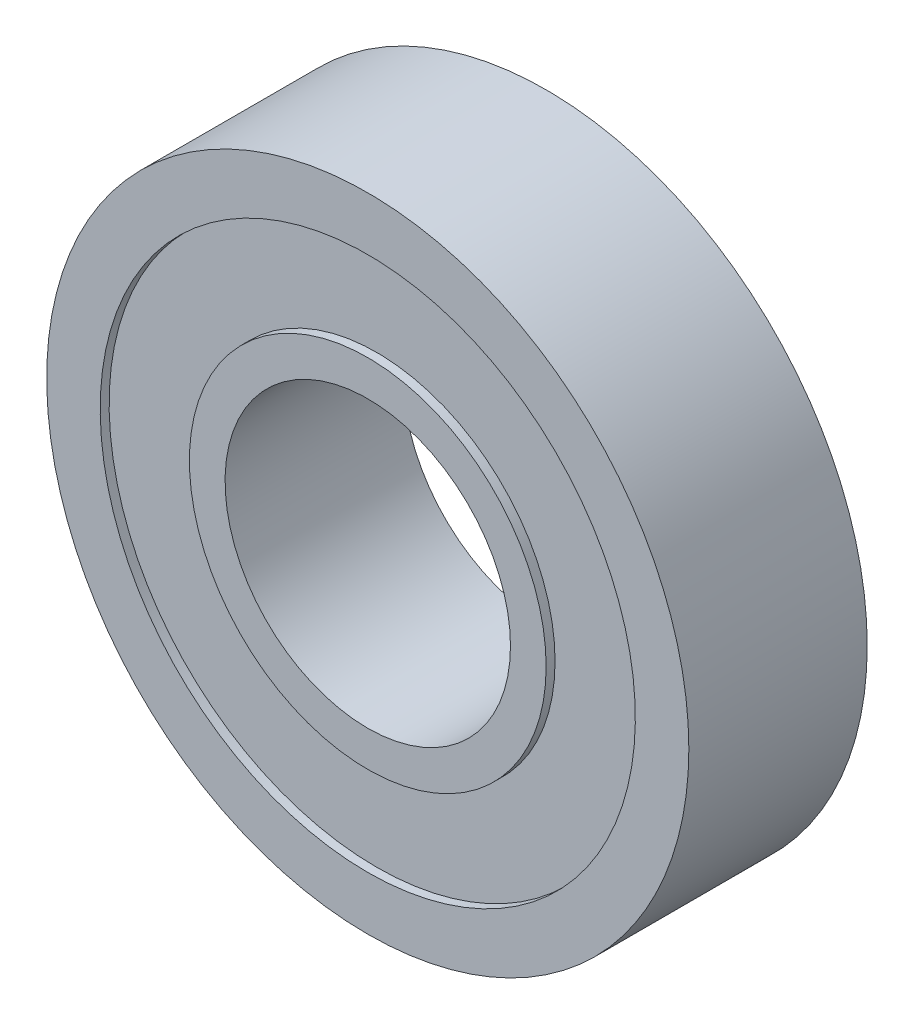
ISO-10303-21;
HEADER;
FILE_DESCRIPTION(('STEP AP214'),'2;1');
FILE_NAME('part.step','',(''),(''),'','','');
FILE_SCHEMA(('AUTOMOTIVE_DESIGN { 1 0 10303 214 1 1 1 1 }'));
ENDSEC;
DATA;
#1=APPLICATION_CONTEXT('core data for automotive mechanical design processes');
#2=APPLICATION_PROTOCOL_DEFINITION('international standard','automotive_design',2000,#1);
#3=PRODUCT_CONTEXT('',#1,'mechanical');
#4=PRODUCT('Part','Part','',(#3));
#5=PRODUCT_RELATED_PRODUCT_CATEGORY('part','',(#4));
#6=PRODUCT_DEFINITION_FORMATION('','',#4);
#7=PRODUCT_DEFINITION_CONTEXT('part definition',#1,'design');
#8=PRODUCT_DEFINITION('design','',#6,#7);
#9=PRODUCT_DEFINITION_SHAPE('','',#8);
#10=(LENGTH_UNIT() NAMED_UNIT(*) SI_UNIT(.MILLI.,.METRE.));
#11=(NAMED_UNIT(*) PLANE_ANGLE_UNIT() SI_UNIT($,.RADIAN.));
#12=(NAMED_UNIT(*) SI_UNIT($,.STERADIAN.) SOLID_ANGLE_UNIT());
#13=UNCERTAINTY_MEASURE_WITH_UNIT(LENGTH_MEASURE(1.E-05),#10,'distance_accuracy_value','');
#14=(GEOMETRIC_REPRESENTATION_CONTEXT(3) GLOBAL_UNCERTAINTY_ASSIGNED_CONTEXT((#13)) GLOBAL_UNIT_ASSIGNED_CONTEXT((#10,
#11,#12)) REPRESENTATION_CONTEXT('',''));
#15=CARTESIAN_POINT('',(0.,0.,0.));
#16=DIRECTION('',(0.,0.,1.));
#17=DIRECTION('',(1.,0.,0.));
#18=AXIS2_PLACEMENT_3D('',#15,#16,#17);
#19=CARTESIAN_POINT('',(0.,0.,-3.96875));
#20=DIRECTION('',(0.,0.,-1.));
#21=DIRECTION('',(0.,-1.,0.));
#22=AXIS2_PLACEMENT_3D('',#19,#20,#21);
#23=CYLINDRICAL_SURFACE('',#22,7.9375);
#24=CARTESIAN_POINT('',(0.,0.,-3.571875));
#25=DIRECTION('',(0.,0.,1.));
#26=DIRECTION('',(1.,0.,0.));
#27=AXIS2_PLACEMENT_3D('',#24,#25,#26);
#28=CIRCLE('',#27,7.9375);
#29=CARTESIAN_POINT('',(7.9375,0.,-3.571875));
#30=VERTEX_POINT('',#29);
#31=EDGE_CURVE('E21',#30,#30,#28,.T.);
#32=ORIENTED_EDGE('',*,*,#31,.F.);
#33=EDGE_LOOP('',(#32));
#34=FACE_BOUND('',#33,.T.);
#35=CARTESIAN_POINT('',(0.,0.,-3.96875));
#36=DIRECTION('',(0.,0.,-1.));
#37=DIRECTION('',(0.,-1.,0.));
#38=AXIS2_PLACEMENT_3D('',#35,#36,#37);
#39=CIRCLE('',#38,7.9375);
#40=CARTESIAN_POINT('',(0.,-7.9375,-3.96875));
#41=VERTEX_POINT('',#40);
#42=EDGE_CURVE('E30',#41,#41,#39,.T.);
#43=ORIENTED_EDGE('',*,*,#42,.F.);
#44=EDGE_LOOP('',(#43));
#45=FACE_BOUND('',#44,.T.);
#46=ADVANCED_FACE('F13',(#34,#45),#23,.T.);
#47=CARTESIAN_POINT('',(0.,0.,-3.96875));
#48=DIRECTION('',(0.,0.,-1.));
#49=DIRECTION('',(0.,-1.,0.));
#50=AXIS2_PLACEMENT_3D('',#47,#48,#49);
#51=CYLINDRICAL_SURFACE('',#50,11.90625);
#52=CARTESIAN_POINT('',(0.,0.,-3.571875));
#53=DIRECTION('',(0.,0.,1.));
#54=DIRECTION('',(1.,0.,0.));
#55=AXIS2_PLACEMENT_3D('',#52,#53,#54);
#56=CIRCLE('',#55,11.90625);
#57=CARTESIAN_POINT('',(11.90625,0.,-3.571875));
#58=VERTEX_POINT('',#57);
#59=EDGE_CURVE('E8',#58,#58,#56,.T.);
#60=ORIENTED_EDGE('',*,*,#59,.T.);
#61=EDGE_LOOP('',(#60));
#62=FACE_BOUND('',#61,.T.);
#63=CARTESIAN_POINT('',(0.,0.,-3.96875));
#64=DIRECTION('',(0.,0.,1.));
#65=DIRECTION('',(1.,0.,0.));
#66=AXIS2_PLACEMENT_3D('',#63,#64,#65);
#67=CIRCLE('',#66,11.90625);
#68=CARTESIAN_POINT('',(11.90625,0.,-3.96875));
#69=VERTEX_POINT('',#68);
#70=EDGE_CURVE('E26',#69,#69,#67,.T.);
#71=ORIENTED_EDGE('',*,*,#70,.F.);
#72=EDGE_LOOP('',(#71));
#73=FACE_BOUND('',#72,.T.);
#74=ADVANCED_FACE('F60',(#62,#73),#51,.F.);
#75=CARTESIAN_POINT('',(0.,0.,-3.571875));
#76=DIRECTION('',(0.,0.,1.));
#77=DIRECTION('',(1.,0.,0.));
#78=AXIS2_PLACEMENT_3D('',#75,#76,#77);
#79=PLANE('',#78);
#80=ORIENTED_EDGE('',*,*,#31,.T.);
#81=EDGE_LOOP('',(#80));
#82=FACE_BOUND('',#81,.T.);
#83=ORIENTED_EDGE('',*,*,#59,.F.);
#84=EDGE_LOOP('',(#83));
#85=FACE_BOUND('',#84,.T.);
#86=ADVANCED_FACE('F67',(#82,#85),#79,.F.);
#87=CARTESIAN_POINT('',(0.,0.,-3.96875));
#88=DIRECTION('',(0.,0.,-1.));
#89=DIRECTION('',(-1.,0.,0.));
#90=AXIS2_PLACEMENT_3D('',#87,#88,#89);
#91=PLANE('',#90);
#92=CARTESIAN_POINT('',(0.,0.,-3.96875));
#93=DIRECTION('',(0.,0.,1.));
#94=DIRECTION('',(1.,0.,0.));
#95=AXIS2_PLACEMENT_3D('',#92,#93,#94);
#96=CIRCLE('',#95,14.2875);
#97=CARTESIAN_POINT('',(14.2875,0.,-3.96875));
#98=VERTEX_POINT('',#97);
#99=EDGE_CURVE('E34',#98,#98,#96,.T.);
#100=ORIENTED_EDGE('',*,*,#99,.F.);
#101=EDGE_LOOP('',(#100));
#102=FACE_BOUND('',#101,.T.);
#103=ORIENTED_EDGE('',*,*,#70,.T.);
#104=EDGE_LOOP('',(#103));
#105=FACE_BOUND('',#104,.T.);
#106=ADVANCED_FACE('F71',(#102,#105),#91,.T.);
#107=CARTESIAN_POINT('',(0.,0.,3.96875));
#108=DIRECTION('',(0.,0.,-1.));
#109=DIRECTION('',(0.,-1.,0.));
#110=AXIS2_PLACEMENT_3D('',#107,#108,#109);
#111=CYLINDRICAL_SURFACE('',#110,7.9375);
#112=CARTESIAN_POINT('',(0.,0.,3.571875));
#113=DIRECTION('',(0.,0.,1.));
#114=DIRECTION('',(1.,0.,0.));
#115=AXIS2_PLACEMENT_3D('',#112,#113,#114);
#116=CIRCLE('',#115,7.9375);
#117=CARTESIAN_POINT('',(7.9375,0.,3.571875));
#118=VERTEX_POINT('',#117);
#119=EDGE_CURVE('E33',#118,#118,#116,.T.);
#120=ORIENTED_EDGE('',*,*,#119,.T.);
#121=EDGE_LOOP('',(#120));
#122=FACE_BOUND('',#121,.T.);
#123=CARTESIAN_POINT('',(0.,0.,3.96875));
#124=DIRECTION('',(0.,0.,1.));
#125=DIRECTION('',(1.,0.,0.));
#126=AXIS2_PLACEMENT_3D('',#123,#124,#125);
#127=CIRCLE('',#126,7.9375);
#128=CARTESIAN_POINT('',(7.9375,0.,3.96875));
#129=VERTEX_POINT('',#128);
#130=EDGE_CURVE('E42',#129,#129,#127,.T.);
#131=ORIENTED_EDGE('',*,*,#130,.F.);
#132=EDGE_LOOP('',(#131));
#133=FACE_BOUND('',#132,.T.);
#134=ADVANCED_FACE('F74',(#122,#133),#111,.T.);
#135=CARTESIAN_POINT('',(0.,0.,3.96875));
#136=DIRECTION('',(0.,0.,-1.));
#137=DIRECTION('',(0.,-1.,0.));
#138=AXIS2_PLACEMENT_3D('',#135,#136,#137);
#139=CYLINDRICAL_SURFACE('',#138,11.90625);
#140=CARTESIAN_POINT('',(0.,0.,3.571875));
#141=DIRECTION('',(0.,0.,1.));
#142=DIRECTION('',(1.,0.,0.));
#143=AXIS2_PLACEMENT_3D('',#140,#141,#142);
#144=CIRCLE('',#143,11.90625);
#145=CARTESIAN_POINT('',(11.90625,0.,3.571875));
#146=VERTEX_POINT('',#145);
#147=EDGE_CURVE('E41',#146,#146,#144,.T.);
#148=ORIENTED_EDGE('',*,*,#147,.F.);
#149=EDGE_LOOP('',(#148));
#150=FACE_BOUND('',#149,.T.);
#151=CARTESIAN_POINT('',(0.,0.,3.96875));
#152=DIRECTION('',(0.,0.,-1.));
#153=DIRECTION('',(0.,-1.,0.));
#154=AXIS2_PLACEMENT_3D('',#151,#152,#153);
#155=CIRCLE('',#154,11.90625);
#156=CARTESIAN_POINT('',(0.,-11.90625,3.96875));
#157=VERTEX_POINT('',#156);
#158=EDGE_CURVE('E47',#157,#157,#155,.T.);
#159=ORIENTED_EDGE('',*,*,#158,.F.);
#160=EDGE_LOOP('',(#159));
#161=FACE_BOUND('',#160,.T.);
#162=ADVANCED_FACE('F80',(#150,#161),#139,.F.);
#163=CARTESIAN_POINT('',(0.,0.,3.571875));
#164=DIRECTION('',(0.,0.,-1.));
#165=DIRECTION('',(-1.,0.,0.));
#166=AXIS2_PLACEMENT_3D('',#163,#164,#165);
#167=PLANE('',#166);
#168=ORIENTED_EDGE('',*,*,#119,.F.);
#169=EDGE_LOOP('',(#168));
#170=FACE_BOUND('',#169,.T.);
#171=ORIENTED_EDGE('',*,*,#147,.T.);
#172=EDGE_LOOP('',(#171));
#173=FACE_BOUND('',#172,.T.);
#174=ADVANCED_FACE('F76',(#170,#173),#167,.F.);
#175=CARTESIAN_POINT('',(0.,0.,3.96875));
#176=DIRECTION('',(0.,0.,-1.));
#177=DIRECTION('',(-1.,0.,0.));
#178=AXIS2_PLACEMENT_3D('',#175,#176,#177);
#179=PLANE('',#178);
#180=CARTESIAN_POINT('',(0.,0.,3.96875));
#181=DIRECTION('',(0.,0.,-1.));
#182=DIRECTION('',(0.,-1.,0.));
#183=AXIS2_PLACEMENT_3D('',#180,#181,#182);
#184=CIRCLE('',#183,14.2875);
#185=CARTESIAN_POINT('',(0.,-14.2875,3.96875));
#186=VERTEX_POINT('',#185);
#187=EDGE_CURVE('E38',#186,#186,#184,.T.);
#188=ORIENTED_EDGE('',*,*,#187,.F.);
#189=EDGE_LOOP('',(#188));
#190=FACE_BOUND('',#189,.T.);
#191=ORIENTED_EDGE('',*,*,#158,.T.);
#192=EDGE_LOOP('',(#191));
#193=FACE_BOUND('',#192,.T.);
#194=ADVANCED_FACE('F79',(#190,#193),#179,.F.);
#195=CARTESIAN_POINT('',(0.,0.,0.));
#196=DIRECTION('',(0.,0.,1.));
#197=DIRECTION('',(1.,0.,0.));
#198=AXIS2_PLACEMENT_3D('',#195,#196,#197);
#199=CYLINDRICAL_SURFACE('',#198,6.35);
#200=CARTESIAN_POINT('',(0.,0.,-3.96875));
#201=DIRECTION('',(0.,0.,1.));
#202=DIRECTION('',(1.,0.,0.));
#203=AXIS2_PLACEMENT_3D('',#200,#201,#202);
#204=CIRCLE('',#203,6.35);
#205=CARTESIAN_POINT('',(6.35,0.,-3.96875));
#206=VERTEX_POINT('',#205);
#207=EDGE_CURVE('E37',#206,#206,#204,.T.);
#208=ORIENTED_EDGE('',*,*,#207,.F.);
#209=EDGE_LOOP('',(#208));
#210=FACE_BOUND('',#209,.T.);
#211=CARTESIAN_POINT('',(0.,0.,3.96875));
#212=DIRECTION('',(0.,0.,-1.));
#213=DIRECTION('',(0.,-1.,0.));
#214=AXIS2_PLACEMENT_3D('',#211,#212,#213);
#215=CIRCLE('',#214,6.35);
#216=CARTESIAN_POINT('',(0.,-6.35,3.96875));
#217=VERTEX_POINT('',#216);
#218=EDGE_CURVE('E17',#217,#217,#215,.T.);
#219=ORIENTED_EDGE('',*,*,#218,.F.);
#220=EDGE_LOOP('',(#219));
#221=FACE_BOUND('',#220,.T.);
#222=ADVANCED_FACE('F84',(#210,#221),#199,.F.);
#223=CARTESIAN_POINT('',(0.,0.,-3.96875));
#224=DIRECTION('',(0.,0.,-1.));
#225=DIRECTION('',(-1.,0.,0.));
#226=AXIS2_PLACEMENT_3D('',#223,#224,#225);
#227=PLANE('',#226);
#228=ORIENTED_EDGE('',*,*,#42,.T.);
#229=EDGE_LOOP('',(#228));
#230=FACE_BOUND('',#229,.T.);
#231=ORIENTED_EDGE('',*,*,#207,.T.);
#232=EDGE_LOOP('',(#231));
#233=FACE_BOUND('',#232,.T.);
#234=ADVANCED_FACE('F57',(#230,#233),#227,.T.);
#235=CARTESIAN_POINT('',(0.,0.,0.));
#236=DIRECTION('',(0.,0.,1.));
#237=DIRECTION('',(1.,0.,0.));
#238=AXIS2_PLACEMENT_3D('',#235,#236,#237);
#239=CYLINDRICAL_SURFACE('',#238,14.2875);
#240=ORIENTED_EDGE('',*,*,#99,.T.);
#241=EDGE_LOOP('',(#240));
#242=FACE_BOUND('',#241,.T.);
#243=ORIENTED_EDGE('',*,*,#187,.T.);
#244=EDGE_LOOP('',(#243));
#245=FACE_BOUND('',#244,.T.);
#246=ADVANCED_FACE('F15',(#242,#245),#239,.T.);
#247=CARTESIAN_POINT('',(0.,0.,3.96875));
#248=DIRECTION('',(0.,0.,-1.));
#249=DIRECTION('',(-1.,0.,0.));
#250=AXIS2_PLACEMENT_3D('',#247,#248,#249);
#251=PLANE('',#250);
#252=ORIENTED_EDGE('',*,*,#130,.T.);
#253=EDGE_LOOP('',(#252));
#254=FACE_BOUND('',#253,.T.);
#255=ORIENTED_EDGE('',*,*,#218,.T.);
#256=EDGE_LOOP('',(#255));
#257=FACE_BOUND('',#256,.T.);
#258=ADVANCED_FACE('F88',(#254,#257),#251,.F.);
#259=CLOSED_SHELL('',(#46,#74,#86,#106,#134,#162,#174,#194,#222,#234,#246,#258));
#260=MANIFOLD_SOLID_BREP('B1',#259);
#261=ADVANCED_BREP_SHAPE_REPRESENTATION('',(#18,#260),#14);
#262=SHAPE_DEFINITION_REPRESENTATION(#9,#261);
ENDSEC;
END-ISO-10303-21;
